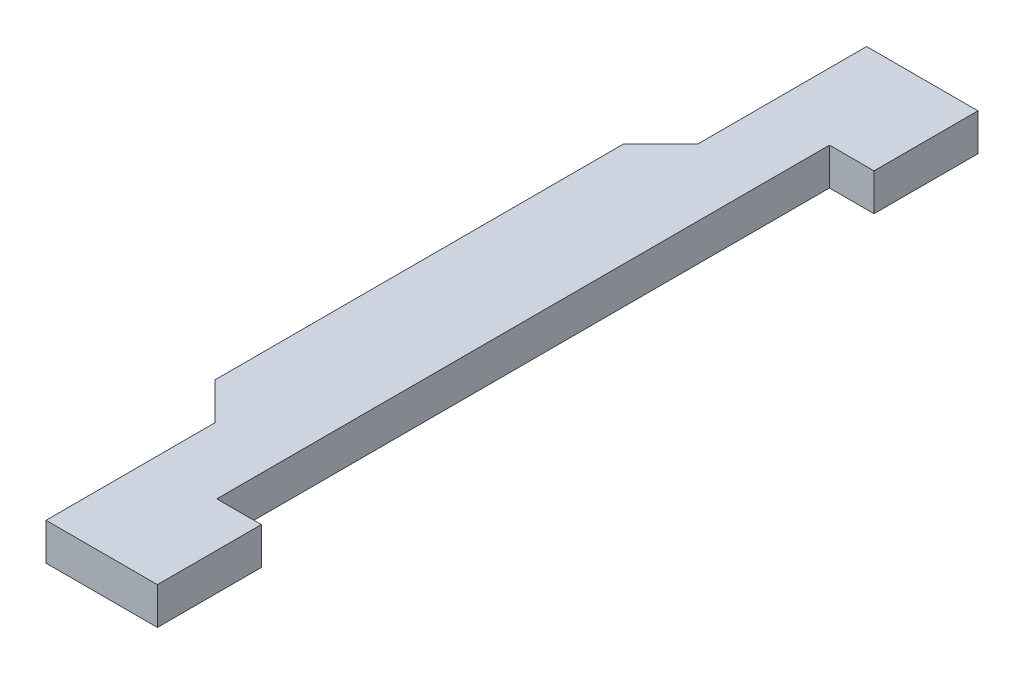
ISO-10303-21;
HEADER;
FILE_DESCRIPTION(('STEP AP214'),'2;1');
FILE_NAME('part.step','',(''),(''),'','','');
FILE_SCHEMA(('AUTOMOTIVE_DESIGN { 1 0 10303 214 1 1 1 1 }'));
ENDSEC;
DATA;
#1=APPLICATION_CONTEXT('core data for automotive mechanical design processes');
#2=APPLICATION_PROTOCOL_DEFINITION('international standard','automotive_design',2000,#1);
#3=PRODUCT_CONTEXT('',#1,'mechanical');
#4=PRODUCT('Part','Part','',(#3));
#5=PRODUCT_RELATED_PRODUCT_CATEGORY('part','',(#4));
#6=PRODUCT_DEFINITION_FORMATION('','',#4);
#7=PRODUCT_DEFINITION_CONTEXT('part definition',#1,'design');
#8=PRODUCT_DEFINITION('design','',#6,#7);
#9=PRODUCT_DEFINITION_SHAPE('','',#8);
#10=(LENGTH_UNIT() NAMED_UNIT(*) SI_UNIT(.MILLI.,.METRE.));
#11=(NAMED_UNIT(*) PLANE_ANGLE_UNIT() SI_UNIT($,.RADIAN.));
#12=(NAMED_UNIT(*) SI_UNIT($,.STERADIAN.) SOLID_ANGLE_UNIT());
#13=UNCERTAINTY_MEASURE_WITH_UNIT(LENGTH_MEASURE(1.E-05),#10,'distance_accuracy_value','');
#14=(GEOMETRIC_REPRESENTATION_CONTEXT(3) GLOBAL_UNCERTAINTY_ASSIGNED_CONTEXT((#13)) GLOBAL_UNIT_ASSIGNED_CONTEXT((#10,
#11,#12)) REPRESENTATION_CONTEXT('',''));
#15=CARTESIAN_POINT('',(0.,0.,0.));
#16=DIRECTION('',(0.,0.,1.));
#17=DIRECTION('',(1.,0.,0.));
#18=AXIS2_PLACEMENT_3D('',#15,#16,#17);
#19=CARTESIAN_POINT('',(0.232367720915515,0.,0.));
#20=DIRECTION('',(0.,-1.,0.));
#21=DIRECTION('',(0.,0.,-1.));
#22=AXIS2_PLACEMENT_3D('',#19,#20,#21);
#23=PLANE('',#22);
#24=DIRECTION('',(-1.,0.,0.));
#25=VECTOR('',#24,1.);
#26=CARTESIAN_POINT('',(2.,0.,-8.25));
#27=LINE('',#26,#25);
#28=CARTESIAN_POINT('',(2.,0.,-8.25));
#29=VERTEX_POINT('',#28);
#30=CARTESIAN_POINT('',(0.8,0.,-8.25));
#31=VERTEX_POINT('',#30);
#32=EDGE_CURVE('E117',#29,#31,#27,.T.);
#33=ORIENTED_EDGE('',*,*,#32,.T.);
#34=DIRECTION('',(0.,0.,1.));
#35=VECTOR('',#34,1.);
#36=CARTESIAN_POINT('',(0.8,0.,-8.25));
#37=LINE('',#36,#35);
#38=CARTESIAN_POINT('',(0.8,0.,8.25));
#39=VERTEX_POINT('',#38);
#40=EDGE_CURVE('E103',#31,#39,#37,.T.);
#41=ORIENTED_EDGE('',*,*,#40,.T.);
#42=DIRECTION('',(1.,0.,0.));
#43=VECTOR('',#42,1.);
#44=CARTESIAN_POINT('',(0.8,0.,8.25));
#45=LINE('',#44,#43);
#46=CARTESIAN_POINT('',(2.,0.,8.25));
#47=VERTEX_POINT('',#46);
#48=EDGE_CURVE('E20',#39,#47,#45,.T.);
#49=ORIENTED_EDGE('',*,*,#48,.T.);
#50=DIRECTION('',(0.,0.,-1.));
#51=VECTOR('',#50,1.);
#52=CARTESIAN_POINT('',(2.,0.,11.05));
#53=LINE('',#52,#51);
#54=CARTESIAN_POINT('',(2.,0.,11.05));
#55=VERTEX_POINT('',#54);
#56=EDGE_CURVE('E177',#55,#47,#53,.T.);
#57=ORIENTED_EDGE('',*,*,#56,.F.);
#58=DIRECTION('',(1.,0.,0.));
#59=VECTOR('',#58,1.);
#60=CARTESIAN_POINT('',(-1.,0.,11.05));
#61=LINE('',#60,#59);
#62=CARTESIAN_POINT('',(-1.,0.,11.05));
#63=VERTEX_POINT('',#62);
#64=EDGE_CURVE('E170',#63,#55,#61,.T.);
#65=ORIENTED_EDGE('',*,*,#64,.F.);
#66=DIRECTION('',(0.,0.,1.));
#67=VECTOR('',#66,1.);
#68=CARTESIAN_POINT('',(-1.,0.,6.5));
#69=LINE('',#68,#67);
#70=CARTESIAN_POINT('',(-1.,0.,6.5));
#71=VERTEX_POINT('',#70);
#72=EDGE_CURVE('E164',#71,#63,#69,.T.);
#73=ORIENTED_EDGE('',*,*,#72,.F.);
#74=DIRECTION('',(0.707106781186548,0.,0.707106781186548));
#75=VECTOR('',#74,1.);
#76=CARTESIAN_POINT('',(-2.,0.,5.5));
#77=LINE('',#76,#75);
#78=CARTESIAN_POINT('',(-2.,0.,5.5));
#79=VERTEX_POINT('',#78);
#80=EDGE_CURVE('E158',#79,#71,#77,.T.);
#81=ORIENTED_EDGE('',*,*,#80,.F.);
#82=DIRECTION('',(0.,0.,1.));
#83=VECTOR('',#82,1.);
#84=CARTESIAN_POINT('',(-2.,0.,-5.5));
#85=LINE('',#84,#83);
#86=CARTESIAN_POINT('',(-2.,0.,-5.5));
#87=VERTEX_POINT('',#86);
#88=EDGE_CURVE('E152',#87,#79,#85,.T.);
#89=ORIENTED_EDGE('',*,*,#88,.F.);
#90=DIRECTION('',(-0.707106781186547,0.,0.707106781186548));
#91=VECTOR('',#90,1.);
#92=CARTESIAN_POINT('',(-1.,0.,-6.5));
#93=LINE('',#92,#91);
#94=CARTESIAN_POINT('',(-1.,0.,-6.5));
#95=VERTEX_POINT('',#94);
#96=EDGE_CURVE('E146',#95,#87,#93,.T.);
#97=ORIENTED_EDGE('',*,*,#96,.F.);
#98=DIRECTION('',(0.,0.,1.));
#99=VECTOR('',#98,1.);
#100=CARTESIAN_POINT('',(-1.,0.,-11.05));
#101=LINE('',#100,#99);
#102=CARTESIAN_POINT('',(-1.,0.,-11.05));
#103=VERTEX_POINT('',#102);
#104=EDGE_CURVE('E140',#103,#95,#101,.T.);
#105=ORIENTED_EDGE('',*,*,#104,.F.);
#106=DIRECTION('',(-1.,0.,0.));
#107=VECTOR('',#106,1.);
#108=CARTESIAN_POINT('',(2.,0.,-11.05));
#109=LINE('',#108,#107);
#110=CARTESIAN_POINT('',(2.,0.,-11.05));
#111=VERTEX_POINT('',#110);
#112=EDGE_CURVE('E134',#111,#103,#109,.T.);
#113=ORIENTED_EDGE('',*,*,#112,.F.);
#114=DIRECTION('',(0.,0.,-1.));
#115=VECTOR('',#114,1.);
#116=CARTESIAN_POINT('',(2.,0.,11.05));
#117=LINE('',#116,#115);
#118=EDGE_CURVE('E131',#29,#111,#117,.T.);
#119=ORIENTED_EDGE('',*,*,#118,.F.);
#120=EDGE_LOOP('',(#33,#41,#49,#57,#65,#73,#81,#89,#97,#105,#113,#119));
#121=FACE_BOUND('',#120,.T.);
#122=ADVANCED_FACE('F17',(#121),#23,.T.);
#123=CARTESIAN_POINT('',(0.8,0.,8.25));
#124=DIRECTION('',(0.,0.,1.));
#125=DIRECTION('',(1.,0.,0.));
#126=AXIS2_PLACEMENT_3D('',#123,#124,#125);
#127=PLANE('',#126);
#128=DIRECTION('',(0.,1.,0.));
#129=VECTOR('',#128,1.);
#130=CARTESIAN_POINT('',(0.8,0.,8.25));
#131=LINE('',#130,#129);
#132=CARTESIAN_POINT('',(0.8,1.,8.25));
#133=VERTEX_POINT('',#132);
#134=EDGE_CURVE('E109',#39,#133,#131,.T.);
#135=ORIENTED_EDGE('',*,*,#134,.T.);
#136=DIRECTION('',(1.,0.,0.));
#137=VECTOR('',#136,1.);
#138=CARTESIAN_POINT('',(0.232367720915515,1.,8.25));
#139=LINE('',#138,#137);
#140=CARTESIAN_POINT('',(2.,1.,8.25));
#141=VERTEX_POINT('',#140);
#142=EDGE_CURVE('E179',#141,#133,#139,.F.);
#143=ORIENTED_EDGE('',*,*,#142,.F.);
#144=DIRECTION('',(0.,1.,0.));
#145=VECTOR('',#144,1.);
#146=CARTESIAN_POINT('',(2.,0.,8.25));
#147=LINE('',#146,#145);
#148=EDGE_CURVE('E112',#47,#141,#147,.T.);
#149=ORIENTED_EDGE('',*,*,#148,.F.);
#150=ORIENTED_EDGE('',*,*,#48,.F.);
#151=EDGE_LOOP('',(#135,#143,#149,#150));
#152=FACE_BOUND('',#151,.T.);
#153=ADVANCED_FACE('F108',(#152),#127,.F.);
#154=CARTESIAN_POINT('',(0.8,0.,-8.25));
#155=DIRECTION('',(-1.,0.,0.));
#156=DIRECTION('',(0.,0.,1.));
#157=AXIS2_PLACEMENT_3D('',#154,#155,#156);
#158=PLANE('',#157);
#159=DIRECTION('',(0.,1.,0.));
#160=VECTOR('',#159,1.);
#161=CARTESIAN_POINT('',(0.8,0.,-8.25));
#162=LINE('',#161,#160);
#163=CARTESIAN_POINT('',(0.8,1.,-8.25));
#164=VERTEX_POINT('',#163);
#165=EDGE_CURVE('E119',#31,#164,#162,.T.);
#166=ORIENTED_EDGE('',*,*,#165,.T.);
#167=DIRECTION('',(0.,0.,1.));
#168=VECTOR('',#167,1.);
#169=CARTESIAN_POINT('',(0.8,1.,0.));
#170=LINE('',#169,#168);
#171=EDGE_CURVE('E123',#133,#164,#170,.F.);
#172=ORIENTED_EDGE('',*,*,#171,.F.);
#173=ORIENTED_EDGE('',*,*,#134,.F.);
#174=ORIENTED_EDGE('',*,*,#40,.F.);
#175=EDGE_LOOP('',(#166,#172,#173,#174));
#176=FACE_BOUND('',#175,.T.);
#177=ADVANCED_FACE('F121',(#176),#158,.F.);
#178=CARTESIAN_POINT('',(2.,0.,-8.25));
#179=DIRECTION('',(0.,0.,-1.));
#180=DIRECTION('',(-1.,0.,0.));
#181=AXIS2_PLACEMENT_3D('',#178,#179,#180);
#182=PLANE('',#181);
#183=DIRECTION('',(0.,1.,0.));
#184=VECTOR('',#183,1.);
#185=CARTESIAN_POINT('',(2.,0.,-8.25));
#186=LINE('',#185,#184);
#187=CARTESIAN_POINT('',(2.,1.,-8.25));
#188=VERTEX_POINT('',#187);
#189=EDGE_CURVE('E128',#188,#29,#186,.F.);
#190=ORIENTED_EDGE('',*,*,#189,.F.);
#191=DIRECTION('',(1.,0.,0.));
#192=VECTOR('',#191,1.);
#193=CARTESIAN_POINT('',(0.232367720915515,1.,-8.25));
#194=LINE('',#193,#192);
#195=EDGE_CURVE('E182',#164,#188,#194,.T.);
#196=ORIENTED_EDGE('',*,*,#195,.F.);
#197=ORIENTED_EDGE('',*,*,#165,.F.);
#198=ORIENTED_EDGE('',*,*,#32,.F.);
#199=EDGE_LOOP('',(#190,#196,#197,#198));
#200=FACE_BOUND('',#199,.T.);
#201=ADVANCED_FACE('F233',(#200),#182,.F.);
#202=CARTESIAN_POINT('',(2.,0.,11.05));
#203=DIRECTION('',(1.,0.,0.));
#204=DIRECTION('',(0.,0.,-1.));
#205=AXIS2_PLACEMENT_3D('',#202,#203,#204);
#206=PLANE('',#205);
#207=DIRECTION('',(0.,1.,0.));
#208=VECTOR('',#207,1.);
#209=CARTESIAN_POINT('',(2.,0.,-11.05));
#210=LINE('',#209,#208);
#211=CARTESIAN_POINT('',(2.,1.,-11.05));
#212=VERTEX_POINT('',#211);
#213=EDGE_CURVE('E137',#212,#111,#210,.F.);
#214=ORIENTED_EDGE('',*,*,#213,.F.);
#215=DIRECTION('',(0.,0.,1.));
#216=VECTOR('',#215,1.);
#217=CARTESIAN_POINT('',(2.,1.,0.));
#218=LINE('',#217,#216);
#219=EDGE_CURVE('E185',#188,#212,#218,.F.);
#220=ORIENTED_EDGE('',*,*,#219,.F.);
#221=ORIENTED_EDGE('',*,*,#189,.T.);
#222=ORIENTED_EDGE('',*,*,#118,.T.);
#223=EDGE_LOOP('',(#214,#220,#221,#222));
#224=FACE_BOUND('',#223,.T.);
#225=ADVANCED_FACE('F230',(#224),#206,.T.);
#226=CARTESIAN_POINT('',(2.,0.,-11.05));
#227=DIRECTION('',(0.,0.,-1.));
#228=DIRECTION('',(-1.,0.,0.));
#229=AXIS2_PLACEMENT_3D('',#226,#227,#228);
#230=PLANE('',#229);
#231=DIRECTION('',(1.,0.,0.));
#232=VECTOR('',#231,1.);
#233=CARTESIAN_POINT('',(0.232367720915515,1.,-11.05));
#234=LINE('',#233,#232);
#235=CARTESIAN_POINT('',(-1.,1.,-11.05));
#236=VERTEX_POINT('',#235);
#237=EDGE_CURVE('E188',#212,#236,#234,.F.);
#238=ORIENTED_EDGE('',*,*,#237,.F.);
#239=ORIENTED_EDGE('',*,*,#213,.T.);
#240=ORIENTED_EDGE('',*,*,#112,.T.);
#241=DIRECTION('',(0.,1.,0.));
#242=VECTOR('',#241,1.);
#243=CARTESIAN_POINT('',(-1.,0.,-11.05));
#244=LINE('',#243,#242);
#245=EDGE_CURVE('E143',#236,#103,#244,.F.);
#246=ORIENTED_EDGE('',*,*,#245,.F.);
#247=EDGE_LOOP('',(#238,#239,#240,#246));
#248=FACE_BOUND('',#247,.T.);
#249=ADVANCED_FACE('F227',(#248),#230,.T.);
#250=CARTESIAN_POINT('',(-1.,0.,-11.05));
#251=DIRECTION('',(-1.,0.,0.));
#252=DIRECTION('',(0.,0.,1.));
#253=AXIS2_PLACEMENT_3D('',#250,#251,#252);
#254=PLANE('',#253);
#255=DIRECTION('',(0.,0.,1.));
#256=VECTOR('',#255,1.);
#257=CARTESIAN_POINT('',(-1.,1.,0.));
#258=LINE('',#257,#256);
#259=CARTESIAN_POINT('',(-1.,1.,-6.5));
#260=VERTEX_POINT('',#259);
#261=EDGE_CURVE('E191',#236,#260,#258,.T.);
#262=ORIENTED_EDGE('',*,*,#261,.F.);
#263=ORIENTED_EDGE('',*,*,#245,.T.);
#264=ORIENTED_EDGE('',*,*,#104,.T.);
#265=DIRECTION('',(0.,1.,0.));
#266=VECTOR('',#265,1.);
#267=CARTESIAN_POINT('',(-1.,0.,-6.5));
#268=LINE('',#267,#266);
#269=EDGE_CURVE('E149',#260,#95,#268,.F.);
#270=ORIENTED_EDGE('',*,*,#269,.F.);
#271=EDGE_LOOP('',(#262,#263,#264,#270));
#272=FACE_BOUND('',#271,.T.);
#273=ADVANCED_FACE('F224',(#272),#254,.T.);
#274=CARTESIAN_POINT('',(-1.,0.,-6.5));
#275=DIRECTION('',(-0.707106781186548,0.,-0.707106781186547));
#276=DIRECTION('',(-0.707106781186547,0.,0.707106781186548));
#277=AXIS2_PLACEMENT_3D('',#274,#275,#276);
#278=PLANE('',#277);
#279=DIRECTION('',(-0.707106781186547,0.,0.707106781186548));
#280=VECTOR('',#279,1.);
#281=CARTESIAN_POINT('',(-1.,1.,-6.5));
#282=LINE('',#281,#280);
#283=CARTESIAN_POINT('',(-2.,1.,-5.5));
#284=VERTEX_POINT('',#283);
#285=EDGE_CURVE('E194',#260,#284,#282,.T.);
#286=ORIENTED_EDGE('',*,*,#285,.F.);
#287=ORIENTED_EDGE('',*,*,#269,.T.);
#288=ORIENTED_EDGE('',*,*,#96,.T.);
#289=DIRECTION('',(0.,1.,0.));
#290=VECTOR('',#289,1.);
#291=CARTESIAN_POINT('',(-2.,0.,-5.5));
#292=LINE('',#291,#290);
#293=EDGE_CURVE('E155',#284,#87,#292,.F.);
#294=ORIENTED_EDGE('',*,*,#293,.F.);
#295=EDGE_LOOP('',(#286,#287,#288,#294));
#296=FACE_BOUND('',#295,.T.);
#297=ADVANCED_FACE('F221',(#296),#278,.T.);
#298=CARTESIAN_POINT('',(-2.,0.,-5.5));
#299=DIRECTION('',(-1.,0.,0.));
#300=DIRECTION('',(0.,0.,1.));
#301=AXIS2_PLACEMENT_3D('',#298,#299,#300);
#302=PLANE('',#301);
#303=DIRECTION('',(0.,0.,1.));
#304=VECTOR('',#303,1.);
#305=CARTESIAN_POINT('',(-2.,1.,0.));
#306=LINE('',#305,#304);
#307=CARTESIAN_POINT('',(-2.,1.,5.5));
#308=VERTEX_POINT('',#307);
#309=EDGE_CURVE('E197',#284,#308,#306,.T.);
#310=ORIENTED_EDGE('',*,*,#309,.F.);
#311=ORIENTED_EDGE('',*,*,#293,.T.);
#312=ORIENTED_EDGE('',*,*,#88,.T.);
#313=DIRECTION('',(0.,1.,0.));
#314=VECTOR('',#313,1.);
#315=CARTESIAN_POINT('',(-2.,0.,5.5));
#316=LINE('',#315,#314);
#317=EDGE_CURVE('E161',#308,#79,#316,.F.);
#318=ORIENTED_EDGE('',*,*,#317,.F.);
#319=EDGE_LOOP('',(#310,#311,#312,#318));
#320=FACE_BOUND('',#319,.T.);
#321=ADVANCED_FACE('F218',(#320),#302,.T.);
#322=CARTESIAN_POINT('',(-2.,0.,5.5));
#323=DIRECTION('',(-0.707106781186548,0.,0.707106781186548));
#324=DIRECTION('',(0.707106781186548,0.,0.707106781186548));
#325=AXIS2_PLACEMENT_3D('',#322,#323,#324);
#326=PLANE('',#325);
#327=DIRECTION('',(0.707106781186547,0.,0.707106781186548));
#328=VECTOR('',#327,1.);
#329=CARTESIAN_POINT('',(-2.,1.,5.5));
#330=LINE('',#329,#328);
#331=CARTESIAN_POINT('',(-1.,1.,6.5));
#332=VERTEX_POINT('',#331);
#333=EDGE_CURVE('E200',#308,#332,#330,.T.);
#334=ORIENTED_EDGE('',*,*,#333,.F.);
#335=ORIENTED_EDGE('',*,*,#317,.T.);
#336=ORIENTED_EDGE('',*,*,#80,.T.);
#337=DIRECTION('',(0.,1.,0.));
#338=VECTOR('',#337,1.);
#339=CARTESIAN_POINT('',(-1.,0.,6.5));
#340=LINE('',#339,#338);
#341=EDGE_CURVE('E167',#332,#71,#340,.F.);
#342=ORIENTED_EDGE('',*,*,#341,.F.);
#343=EDGE_LOOP('',(#334,#335,#336,#342));
#344=FACE_BOUND('',#343,.T.);
#345=ADVANCED_FACE('F215',(#344),#326,.T.);
#346=CARTESIAN_POINT('',(-1.,0.,6.5));
#347=DIRECTION('',(-1.,0.,0.));
#348=DIRECTION('',(0.,0.,1.));
#349=AXIS2_PLACEMENT_3D('',#346,#347,#348);
#350=PLANE('',#349);
#351=DIRECTION('',(0.,0.,1.));
#352=VECTOR('',#351,1.);
#353=CARTESIAN_POINT('',(-1.,1.,0.));
#354=LINE('',#353,#352);
#355=CARTESIAN_POINT('',(-1.,1.,11.05));
#356=VERTEX_POINT('',#355);
#357=EDGE_CURVE('E203',#332,#356,#354,.T.);
#358=ORIENTED_EDGE('',*,*,#357,.F.);
#359=ORIENTED_EDGE('',*,*,#341,.T.);
#360=ORIENTED_EDGE('',*,*,#72,.T.);
#361=DIRECTION('',(0.,1.,0.));
#362=VECTOR('',#361,1.);
#363=CARTESIAN_POINT('',(-1.,0.,11.05));
#364=LINE('',#363,#362);
#365=EDGE_CURVE('E172',#356,#63,#364,.F.);
#366=ORIENTED_EDGE('',*,*,#365,.F.);
#367=EDGE_LOOP('',(#358,#359,#360,#366));
#368=FACE_BOUND('',#367,.T.);
#369=ADVANCED_FACE('F212',(#368),#350,.T.);
#370=CARTESIAN_POINT('',(-1.,0.,11.05));
#371=DIRECTION('',(0.,0.,1.));
#372=DIRECTION('',(1.,0.,0.));
#373=AXIS2_PLACEMENT_3D('',#370,#371,#372);
#374=PLANE('',#373);
#375=DIRECTION('',(1.,0.,0.));
#376=VECTOR('',#375,1.);
#377=CARTESIAN_POINT('',(0.232367720915515,1.,11.05));
#378=LINE('',#377,#376);
#379=CARTESIAN_POINT('',(2.,1.,11.05));
#380=VERTEX_POINT('',#379);
#381=EDGE_CURVE('E26',#356,#380,#378,.T.);
#382=ORIENTED_EDGE('',*,*,#381,.F.);
#383=ORIENTED_EDGE('',*,*,#365,.T.);
#384=ORIENTED_EDGE('',*,*,#64,.T.);
#385=DIRECTION('',(0.,1.,0.));
#386=VECTOR('',#385,1.);
#387=CARTESIAN_POINT('',(2.,0.,11.05));
#388=LINE('',#387,#386);
#389=EDGE_CURVE('E35',#380,#55,#388,.F.);
#390=ORIENTED_EDGE('',*,*,#389,.F.);
#391=EDGE_LOOP('',(#382,#383,#384,#390));
#392=FACE_BOUND('',#391,.T.);
#393=ADVANCED_FACE('F210',(#392),#374,.T.);
#394=CARTESIAN_POINT('',(2.,0.,11.05));
#395=DIRECTION('',(1.,0.,0.));
#396=DIRECTION('',(0.,0.,-1.));
#397=AXIS2_PLACEMENT_3D('',#394,#395,#396);
#398=PLANE('',#397);
#399=ORIENTED_EDGE('',*,*,#389,.T.);
#400=ORIENTED_EDGE('',*,*,#56,.T.);
#401=ORIENTED_EDGE('',*,*,#148,.T.);
#402=DIRECTION('',(0.,0.,1.));
#403=VECTOR('',#402,1.);
#404=CARTESIAN_POINT('',(2.,1.,0.));
#405=LINE('',#404,#403);
#406=EDGE_CURVE('E11',#380,#141,#405,.F.);
#407=ORIENTED_EDGE('',*,*,#406,.F.);
#408=EDGE_LOOP('',(#399,#400,#401,#407));
#409=FACE_BOUND('',#408,.T.);
#410=ADVANCED_FACE('F235',(#409),#398,.T.);
#411=CARTESIAN_POINT('',(0.232367720915515,1.,0.));
#412=DIRECTION('',(0.,1.,0.));
#413=DIRECTION('',(0.,0.,1.));
#414=AXIS2_PLACEMENT_3D('',#411,#412,#413);
#415=PLANE('',#414);
#416=ORIENTED_EDGE('',*,*,#381,.T.);
#417=ORIENTED_EDGE('',*,*,#406,.T.);
#418=ORIENTED_EDGE('',*,*,#142,.T.);
#419=ORIENTED_EDGE('',*,*,#171,.T.);
#420=ORIENTED_EDGE('',*,*,#195,.T.);
#421=ORIENTED_EDGE('',*,*,#219,.T.);
#422=ORIENTED_EDGE('',*,*,#237,.T.);
#423=ORIENTED_EDGE('',*,*,#261,.T.);
#424=ORIENTED_EDGE('',*,*,#285,.T.);
#425=ORIENTED_EDGE('',*,*,#309,.T.);
#426=ORIENTED_EDGE('',*,*,#333,.T.);
#427=ORIENTED_EDGE('',*,*,#357,.T.);
#428=EDGE_LOOP('',(#416,#417,#418,#419,#420,#421,#422,#423,#424,#425,#426,#427));
#429=FACE_BOUND('',#428,.T.);
#430=ADVANCED_FACE('F208',(#429),#415,.T.);
#431=CLOSED_SHELL('',(#122,#153,#177,#201,#225,#249,#273,#297,#321,#345,#369,#393,#410,#430));
#432=MANIFOLD_SOLID_BREP('B1',#431);
#433=ADVANCED_BREP_SHAPE_REPRESENTATION('',(#18,#432),#14);
#434=SHAPE_DEFINITION_REPRESENTATION(#9,#433);
ENDSEC;
END-ISO-10303-21;
